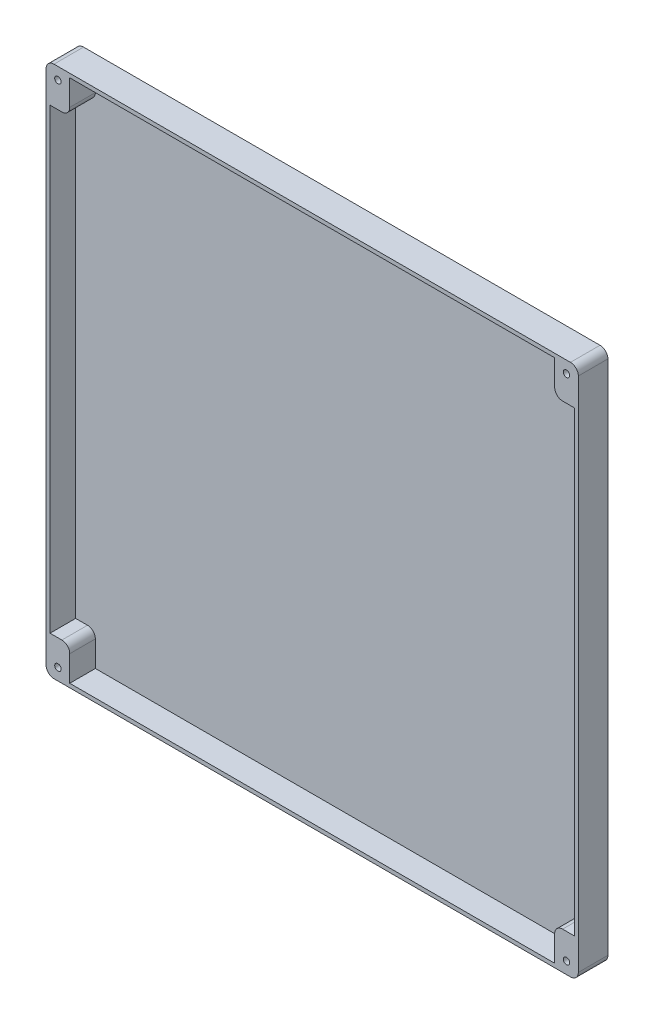
ISO-10303-21;
HEADER;
FILE_DESCRIPTION(('STEP AP214'),'2;1');
FILE_NAME('part.step','',(''),(''),'','','');
FILE_SCHEMA(('AUTOMOTIVE_DESIGN { 1 0 10303 214 1 1 1 1 }'));
ENDSEC;
DATA;
#1=APPLICATION_CONTEXT('core data for automotive mechanical design processes');
#2=APPLICATION_PROTOCOL_DEFINITION('international standard','automotive_design',2000,#1);
#3=PRODUCT_CONTEXT('',#1,'mechanical');
#4=PRODUCT('Part','Part','',(#3));
#5=PRODUCT_RELATED_PRODUCT_CATEGORY('part','',(#4));
#6=PRODUCT_DEFINITION_FORMATION('','',#4);
#7=PRODUCT_DEFINITION_CONTEXT('part definition',#1,'design');
#8=PRODUCT_DEFINITION('design','',#6,#7);
#9=PRODUCT_DEFINITION_SHAPE('','',#8);
#10=(LENGTH_UNIT() NAMED_UNIT(*) SI_UNIT(.MILLI.,.METRE.));
#11=(NAMED_UNIT(*) PLANE_ANGLE_UNIT() SI_UNIT($,.RADIAN.));
#12=(NAMED_UNIT(*) SI_UNIT($,.STERADIAN.) SOLID_ANGLE_UNIT());
#13=UNCERTAINTY_MEASURE_WITH_UNIT(LENGTH_MEASURE(1.E-05),#10,'distance_accuracy_value','');
#14=(GEOMETRIC_REPRESENTATION_CONTEXT(3) GLOBAL_UNCERTAINTY_ASSIGNED_CONTEXT((#13)) GLOBAL_UNIT_ASSIGNED_CONTEXT((#10,
#11,#12)) REPRESENTATION_CONTEXT('',''));
#15=CARTESIAN_POINT('',(0.,0.,0.));
#16=DIRECTION('',(0.,0.,1.));
#17=DIRECTION('',(1.,0.,0.));
#18=AXIS2_PLACEMENT_3D('',#15,#16,#17);
#19=CARTESIAN_POINT('',(0.,0.,15.));
#20=DIRECTION('',(1.,0.,0.));
#21=DIRECTION('',(0.,1.,0.));
#22=AXIS2_PLACEMENT_3D('',#19,#20,#21);
#23=PLANE('',#22);
#24=DIRECTION('',(0.,-1.,0.));
#25=VECTOR('',#24,1.);
#26=CARTESIAN_POINT('',(0.,0.,0.));
#27=LINE('',#26,#25);
#28=CARTESIAN_POINT('',(0.,-4.,0.));
#29=VERTEX_POINT('',#28);
#30=CARTESIAN_POINT('',(0.,-266.,0.));
#31=VERTEX_POINT('',#30);
#32=EDGE_CURVE('E275',#29,#31,#27,.T.);
#33=ORIENTED_EDGE('',*,*,#32,.T.);
#34=DIRECTION('',(0.,0.,-1.));
#35=VECTOR('',#34,1.);
#36=CARTESIAN_POINT('',(0.,-266.,15.));
#37=LINE('',#36,#35);
#38=CARTESIAN_POINT('',(0.,-266.,15.));
#39=VERTEX_POINT('',#38);
#40=EDGE_CURVE('E329',#31,#39,#37,.F.);
#41=ORIENTED_EDGE('',*,*,#40,.T.);
#42=DIRECTION('',(0.,-1.,0.));
#43=VECTOR('',#42,1.);
#44=CARTESIAN_POINT('',(0.,0.,15.));
#45=LINE('',#44,#43);
#46=CARTESIAN_POINT('',(0.,-4.,15.));
#47=VERTEX_POINT('',#46);
#48=EDGE_CURVE('E290',#47,#39,#45,.T.);
#49=ORIENTED_EDGE('',*,*,#48,.F.);
#50=DIRECTION('',(0.,0.,-1.));
#51=VECTOR('',#50,1.);
#52=CARTESIAN_POINT('',(0.,-4.,15.));
#53=LINE('',#52,#51);
#54=EDGE_CURVE('E326',#47,#29,#53,.T.);
#55=ORIENTED_EDGE('',*,*,#54,.T.);
#56=EDGE_LOOP('',(#33,#41,#49,#55));
#57=FACE_BOUND('',#56,.T.);
#58=ADVANCED_FACE('F31',(#57),#23,.F.);
#59=CARTESIAN_POINT('',(0.,-270.,15.));
#60=DIRECTION('',(0.,1.,0.));
#61=DIRECTION('',(0.,0.,1.));
#62=AXIS2_PLACEMENT_3D('',#59,#60,#61);
#63=PLANE('',#62);
#64=DIRECTION('',(1.,0.,0.));
#65=VECTOR('',#64,1.);
#66=CARTESIAN_POINT('',(0.,-270.,15.));
#67=LINE('',#66,#65);
#68=CARTESIAN_POINT('',(4.00000000000003,-270.,15.));
#69=VERTEX_POINT('',#68);
#70=CARTESIAN_POINT('',(266.,-270.,15.));
#71=VERTEX_POINT('',#70);
#72=EDGE_CURVE('E293',#69,#71,#67,.T.);
#73=ORIENTED_EDGE('',*,*,#72,.F.);
#74=DIRECTION('',(0.,0.,-1.));
#75=VECTOR('',#74,1.);
#76=CARTESIAN_POINT('',(4.00000000000003,-270.,15.));
#77=LINE('',#76,#75);
#78=CARTESIAN_POINT('',(4.00000000000003,-270.,0.));
#79=VERTEX_POINT('',#78);
#80=EDGE_CURVE('E315',#69,#79,#77,.T.);
#81=ORIENTED_EDGE('',*,*,#80,.T.);
#82=DIRECTION('',(1.,0.,0.));
#83=VECTOR('',#82,1.);
#84=CARTESIAN_POINT('',(0.,-270.,0.));
#85=LINE('',#84,#83);
#86=CARTESIAN_POINT('',(266.,-270.,0.));
#87=VERTEX_POINT('',#86);
#88=EDGE_CURVE('E306',#79,#87,#85,.T.);
#89=ORIENTED_EDGE('',*,*,#88,.T.);
#90=DIRECTION('',(0.,0.,-1.));
#91=VECTOR('',#90,1.);
#92=CARTESIAN_POINT('',(266.,-270.,15.));
#93=LINE('',#92,#91);
#94=EDGE_CURVE('E303',#87,#71,#93,.F.);
#95=ORIENTED_EDGE('',*,*,#94,.T.);
#96=EDGE_LOOP('',(#73,#81,#89,#95));
#97=FACE_BOUND('',#96,.T.);
#98=ADVANCED_FACE('F442',(#97),#63,.F.);
#99=CARTESIAN_POINT('',(270.,0.,15.));
#100=DIRECTION('',(-1.,0.,0.));
#101=DIRECTION('',(0.,-1.,0.));
#102=AXIS2_PLACEMENT_3D('',#99,#100,#101);
#103=PLANE('',#102);
#104=DIRECTION('',(0.,1.,0.));
#105=VECTOR('',#104,1.);
#106=CARTESIAN_POINT('',(270.,0.,15.));
#107=LINE('',#106,#105);
#108=CARTESIAN_POINT('',(270.,-266.,15.));
#109=VERTEX_POINT('',#108);
#110=CARTESIAN_POINT('',(270.,-4.,15.));
#111=VERTEX_POINT('',#110);
#112=EDGE_CURVE('E297',#109,#111,#107,.T.);
#113=ORIENTED_EDGE('',*,*,#112,.F.);
#114=DIRECTION('',(0.,0.,-1.));
#115=VECTOR('',#114,1.);
#116=CARTESIAN_POINT('',(270.,-266.,15.));
#117=LINE('',#116,#115);
#118=CARTESIAN_POINT('',(270.,-266.,0.));
#119=VERTEX_POINT('',#118);
#120=EDGE_CURVE('E341',#109,#119,#117,.T.);
#121=ORIENTED_EDGE('',*,*,#120,.T.);
#122=DIRECTION('',(0.,1.,0.));
#123=VECTOR('',#122,1.);
#124=CARTESIAN_POINT('',(270.,0.,0.));
#125=LINE('',#124,#123);
#126=CARTESIAN_POINT('',(270.,-4.,0.));
#127=VERTEX_POINT('',#126);
#128=EDGE_CURVE('E309',#119,#127,#125,.T.);
#129=ORIENTED_EDGE('',*,*,#128,.T.);
#130=DIRECTION('',(0.,0.,-1.));
#131=VECTOR('',#130,1.);
#132=CARTESIAN_POINT('',(270.,-4.,15.));
#133=LINE('',#132,#131);
#134=EDGE_CURVE('E339',#127,#111,#133,.F.);
#135=ORIENTED_EDGE('',*,*,#134,.T.);
#136=EDGE_LOOP('',(#113,#121,#129,#135));
#137=FACE_BOUND('',#136,.T.);
#138=ADVANCED_FACE('F448',(#137),#103,.F.);
#139=CARTESIAN_POINT('',(0.,0.,15.));
#140=DIRECTION('',(0.,-1.,0.));
#141=DIRECTION('',(0.,0.,-1.));
#142=AXIS2_PLACEMENT_3D('',#139,#140,#141);
#143=PLANE('',#142);
#144=DIRECTION('',(-1.,0.,0.));
#145=VECTOR('',#144,1.);
#146=CARTESIAN_POINT('',(0.,0.,0.));
#147=LINE('',#146,#145);
#148=CARTESIAN_POINT('',(266.,0.,0.));
#149=VERTEX_POINT('',#148);
#150=CARTESIAN_POINT('',(4.,0.,0.));
#151=VERTEX_POINT('',#150);
#152=EDGE_CURVE('E294',#149,#151,#147,.T.);
#153=ORIENTED_EDGE('',*,*,#152,.T.);
#154=DIRECTION('',(0.,0.,-1.));
#155=VECTOR('',#154,1.);
#156=CARTESIAN_POINT('',(4.,0.,15.));
#157=LINE('',#156,#155);
#158=CARTESIAN_POINT('',(4.,0.,15.));
#159=VERTEX_POINT('',#158);
#160=EDGE_CURVE('E347',#151,#159,#157,.F.);
#161=ORIENTED_EDGE('',*,*,#160,.T.);
#162=DIRECTION('',(-1.,0.,0.));
#163=VECTOR('',#162,1.);
#164=CARTESIAN_POINT('',(0.,0.,15.));
#165=LINE('',#164,#163);
#166=CARTESIAN_POINT('',(266.,0.,15.));
#167=VERTEX_POINT('',#166);
#168=EDGE_CURVE('E300',#167,#159,#165,.T.);
#169=ORIENTED_EDGE('',*,*,#168,.F.);
#170=DIRECTION('',(0.,0.,-1.));
#171=VECTOR('',#170,1.);
#172=CARTESIAN_POINT('',(266.,0.,15.));
#173=LINE('',#172,#171);
#174=EDGE_CURVE('E344',#167,#149,#173,.T.);
#175=ORIENTED_EDGE('',*,*,#174,.T.);
#176=EDGE_LOOP('',(#153,#161,#169,#175));
#177=FACE_BOUND('',#176,.T.);
#178=ADVANCED_FACE('F509',(#177),#143,.F.);
#179=CARTESIAN_POINT('',(0.,-270.,15.));
#180=DIRECTION('',(0.,0.,1.));
#181=DIRECTION('',(1.,0.,0.));
#182=AXIS2_PLACEMENT_3D('',#179,#180,#181);
#183=PLANE('',#182);
#184=CARTESIAN_POINT('',(264.,-6.,15.));
#185=DIRECTION('',(0.,0.,-1.));
#186=DIRECTION('',(-1.,0.,0.));
#187=AXIS2_PLACEMENT_3D('',#184,#185,#186);
#188=CIRCLE('',#187,1.63194999999999);
#189=CARTESIAN_POINT('',(262.36805,-6.,15.));
#190=VERTEX_POINT('',#189);
#191=EDGE_CURVE('E828',#190,#190,#188,.T.);
#192=ORIENTED_EDGE('',*,*,#191,.T.);
#193=EDGE_LOOP('',(#192));
#194=FACE_BOUND('',#193,.T.);
#195=CARTESIAN_POINT('',(6.,-6.,15.));
#196=DIRECTION('',(0.,0.,-1.));
#197=DIRECTION('',(-1.,0.,0.));
#198=AXIS2_PLACEMENT_3D('',#195,#196,#197);
#199=CIRCLE('',#198,1.63195);
#200=CARTESIAN_POINT('',(4.36805000000001,-6.,15.));
#201=VERTEX_POINT('',#200);
#202=EDGE_CURVE('E843',#201,#201,#199,.T.);
#203=ORIENTED_EDGE('',*,*,#202,.T.);
#204=EDGE_LOOP('',(#203));
#205=FACE_BOUND('',#204,.T.);
#206=CARTESIAN_POINT('',(6.,-264.,15.));
#207=DIRECTION('',(0.,0.,-1.));
#208=DIRECTION('',(-1.,0.,0.));
#209=AXIS2_PLACEMENT_3D('',#206,#207,#208);
#210=CIRCLE('',#209,1.63195);
#211=CARTESIAN_POINT('',(4.36805000000001,-264.,15.));
#212=VERTEX_POINT('',#211);
#213=EDGE_CURVE('E858',#212,#212,#210,.T.);
#214=ORIENTED_EDGE('',*,*,#213,.T.);
#215=EDGE_LOOP('',(#214));
#216=FACE_BOUND('',#215,.T.);
#217=CARTESIAN_POINT('',(264.,-264.,15.));
#218=DIRECTION('',(0.,0.,-1.));
#219=DIRECTION('',(-1.,0.,0.));
#220=AXIS2_PLACEMENT_3D('',#217,#218,#219);
#221=CIRCLE('',#220,1.63194999999999);
#222=CARTESIAN_POINT('',(262.36805,-264.,15.));
#223=VERTEX_POINT('',#222);
#224=EDGE_CURVE('E222',#223,#223,#221,.T.);
#225=ORIENTED_EDGE('',*,*,#224,.T.);
#226=EDGE_LOOP('',(#225));
#227=FACE_BOUND('',#226,.T.);
#228=DIRECTION('',(0.,1.,0.));
#229=VECTOR('',#228,1.);
#230=CARTESIAN_POINT('',(258.,-19.,15.));
#231=LINE('',#230,#229);
#232=CARTESIAN_POINT('',(258.,-15.,15.));
#233=VERTEX_POINT('',#232);
#234=CARTESIAN_POINT('',(258.,-2.,15.));
#235=VERTEX_POINT('',#234);
#236=EDGE_CURVE('E217',#233,#235,#231,.T.);
#237=ORIENTED_EDGE('',*,*,#236,.F.);
#238=CARTESIAN_POINT('',(262.,-15.,15.));
#239=DIRECTION('',(0.,0.,1.));
#240=DIRECTION('',(1.,0.,0.));
#241=AXIS2_PLACEMENT_3D('',#238,#239,#240);
#242=CIRCLE('',#241,4.);
#243=CARTESIAN_POINT('',(262.,-19.,15.));
#244=VERTEX_POINT('',#243);
#245=EDGE_CURVE('E358',#233,#244,#242,.T.);
#246=ORIENTED_EDGE('',*,*,#245,.T.);
#247=DIRECTION('',(-1.,0.,0.));
#248=VECTOR('',#247,1.);
#249=CARTESIAN_POINT('',(268.,-19.,15.));
#250=LINE('',#249,#248);
#251=CARTESIAN_POINT('',(268.,-19.,15.));
#252=VERTEX_POINT('',#251);
#253=EDGE_CURVE('E219',#252,#244,#250,.T.);
#254=ORIENTED_EDGE('',*,*,#253,.F.);
#255=DIRECTION('',(0.,1.,0.));
#256=VECTOR('',#255,1.);
#257=CARTESIAN_POINT('',(268.,-251.,15.));
#258=LINE('',#257,#256);
#259=CARTESIAN_POINT('',(268.,-251.,15.));
#260=VERTEX_POINT('',#259);
#261=EDGE_CURVE('E268',#260,#252,#258,.T.);
#262=ORIENTED_EDGE('',*,*,#261,.F.);
#263=DIRECTION('',(1.,0.,0.));
#264=VECTOR('',#263,1.);
#265=CARTESIAN_POINT('',(258.,-251.,15.));
#266=LINE('',#265,#264);
#267=CARTESIAN_POINT('',(262.,-251.,15.));
#268=VERTEX_POINT('',#267);
#269=EDGE_CURVE('E266',#268,#260,#266,.T.);
#270=ORIENTED_EDGE('',*,*,#269,.F.);
#271=CARTESIAN_POINT('',(262.,-255.,15.));
#272=DIRECTION('',(0.,0.,1.));
#273=DIRECTION('',(1.,0.,0.));
#274=AXIS2_PLACEMENT_3D('',#271,#272,#273);
#275=CIRCLE('',#274,4.);
#276=CARTESIAN_POINT('',(258.,-255.,15.));
#277=VERTEX_POINT('',#276);
#278=EDGE_CURVE('E356',#268,#277,#275,.T.);
#279=ORIENTED_EDGE('',*,*,#278,.T.);
#280=DIRECTION('',(0.,1.,0.));
#281=VECTOR('',#280,1.);
#282=CARTESIAN_POINT('',(258.,-268.,15.));
#283=LINE('',#282,#281);
#284=CARTESIAN_POINT('',(258.,-268.,15.));
#285=VERTEX_POINT('',#284);
#286=EDGE_CURVE('E263',#285,#277,#283,.T.);
#287=ORIENTED_EDGE('',*,*,#286,.F.);
#288=DIRECTION('',(1.,0.,0.));
#289=VECTOR('',#288,1.);
#290=CARTESIAN_POINT('',(12.0000000000001,-268.,15.));
#291=LINE('',#290,#289);
#292=CARTESIAN_POINT('',(12.0000000000001,-268.,15.));
#293=VERTEX_POINT('',#292);
#294=EDGE_CURVE('E260',#293,#285,#291,.T.);
#295=ORIENTED_EDGE('',*,*,#294,.F.);
#296=DIRECTION('',(0.,-1.,0.));
#297=VECTOR('',#296,1.);
#298=CARTESIAN_POINT('',(12.0000000000001,-251.,15.));
#299=LINE('',#298,#297);
#300=CARTESIAN_POINT('',(12.0000000000001,-255.,15.));
#301=VERTEX_POINT('',#300);
#302=EDGE_CURVE('E258',#301,#293,#299,.T.);
#303=ORIENTED_EDGE('',*,*,#302,.F.);
#304=CARTESIAN_POINT('',(8.00000000000009,-255.,15.));
#305=DIRECTION('',(0.,0.,1.));
#306=DIRECTION('',(1.,0.,0.));
#307=AXIS2_PLACEMENT_3D('',#304,#305,#306);
#308=CIRCLE('',#307,4.);
#309=CARTESIAN_POINT('',(8.00000000000009,-251.,15.));
#310=VERTEX_POINT('',#309);
#311=EDGE_CURVE('E352',#301,#310,#308,.T.);
#312=ORIENTED_EDGE('',*,*,#311,.T.);
#313=DIRECTION('',(1.,0.,0.));
#314=VECTOR('',#313,1.);
#315=CARTESIAN_POINT('',(2.00000000000003,-251.,15.));
#316=LINE('',#315,#314);
#317=CARTESIAN_POINT('',(2.00000000000003,-251.,15.));
#318=VERTEX_POINT('',#317);
#319=EDGE_CURVE('E256',#318,#310,#316,.T.);
#320=ORIENTED_EDGE('',*,*,#319,.F.);
#321=DIRECTION('',(0.,-1.,0.));
#322=VECTOR('',#321,1.);
#323=CARTESIAN_POINT('',(2.,-19.,15.));
#324=LINE('',#323,#322);
#325=CARTESIAN_POINT('',(2.,-19.,15.));
#326=VERTEX_POINT('',#325);
#327=EDGE_CURVE('E253',#326,#318,#324,.T.);
#328=ORIENTED_EDGE('',*,*,#327,.F.);
#329=DIRECTION('',(-1.,0.,0.));
#330=VECTOR('',#329,1.);
#331=CARTESIAN_POINT('',(12.,-19.,15.));
#332=LINE('',#331,#330);
#333=CARTESIAN_POINT('',(7.99999999999999,-19.,15.));
#334=VERTEX_POINT('',#333);
#335=EDGE_CURVE('E251',#334,#326,#332,.T.);
#336=ORIENTED_EDGE('',*,*,#335,.F.);
#337=CARTESIAN_POINT('',(8.,-15.,15.));
#338=DIRECTION('',(0.,0.,1.));
#339=DIRECTION('',(1.,0.,0.));
#340=AXIS2_PLACEMENT_3D('',#337,#338,#339);
#341=CIRCLE('',#340,4.);
#342=CARTESIAN_POINT('',(12.,-15.,15.));
#343=VERTEX_POINT('',#342);
#344=EDGE_CURVE('E354',#334,#343,#341,.T.);
#345=ORIENTED_EDGE('',*,*,#344,.T.);
#346=DIRECTION('',(0.,-1.,0.));
#347=VECTOR('',#346,1.);
#348=CARTESIAN_POINT('',(12.,-2.,15.));
#349=LINE('',#348,#347);
#350=CARTESIAN_POINT('',(12.,-2.,15.));
#351=VERTEX_POINT('',#350);
#352=EDGE_CURVE('E249',#351,#343,#349,.T.);
#353=ORIENTED_EDGE('',*,*,#352,.F.);
#354=DIRECTION('',(-1.,0.,0.));
#355=VECTOR('',#354,1.);
#356=CARTESIAN_POINT('',(258.,-2.,15.));
#357=LINE('',#356,#355);
#358=EDGE_CURVE('E199',#235,#351,#357,.T.);
#359=ORIENTED_EDGE('',*,*,#358,.F.);
#360=EDGE_LOOP('',(#237,#246,#254,#262,#270,#279,#287,#295,#303,#312,#320,#328,#336,#345,#353,#359));
#361=FACE_BOUND('',#360,.T.);
#362=ORIENTED_EDGE('',*,*,#48,.T.);
#363=CARTESIAN_POINT('',(4.00000000000003,-266.,15.));
#364=DIRECTION('',(0.,0.,1.));
#365=DIRECTION('',(1.,0.,0.));
#366=AXIS2_PLACEMENT_3D('',#363,#364,#365);
#367=CIRCLE('',#366,4.);
#368=EDGE_CURVE('E337',#39,#69,#367,.T.);
#369=ORIENTED_EDGE('',*,*,#368,.T.);
#370=ORIENTED_EDGE('',*,*,#72,.T.);
#371=CARTESIAN_POINT('',(266.,-266.,15.));
#372=DIRECTION('',(0.,0.,1.));
#373=DIRECTION('',(1.,0.,0.));
#374=AXIS2_PLACEMENT_3D('',#371,#372,#373);
#375=CIRCLE('',#374,4.);
#376=EDGE_CURVE('E335',#71,#109,#375,.T.);
#377=ORIENTED_EDGE('',*,*,#376,.T.);
#378=ORIENTED_EDGE('',*,*,#112,.T.);
#379=CARTESIAN_POINT('',(266.,-4.,15.));
#380=DIRECTION('',(0.,0.,1.));
#381=DIRECTION('',(1.,0.,0.));
#382=AXIS2_PLACEMENT_3D('',#379,#380,#381);
#383=CIRCLE('',#382,4.);
#384=EDGE_CURVE('E331',#111,#167,#383,.T.);
#385=ORIENTED_EDGE('',*,*,#384,.T.);
#386=ORIENTED_EDGE('',*,*,#168,.T.);
#387=CARTESIAN_POINT('',(4.,-4.,15.));
#388=DIRECTION('',(0.,0.,1.));
#389=DIRECTION('',(1.,0.,0.));
#390=AXIS2_PLACEMENT_3D('',#387,#388,#389);
#391=CIRCLE('',#390,4.);
#392=EDGE_CURVE('E333',#159,#47,#391,.T.);
#393=ORIENTED_EDGE('',*,*,#392,.T.);
#394=EDGE_LOOP('',(#362,#369,#370,#377,#378,#385,#386,#393));
#395=FACE_BOUND('',#394,.T.);
#396=ADVANCED_FACE('F389',(#194,#205,#216,#227,#361,#395),#183,.T.);
#397=CARTESIAN_POINT('',(0.,-270.,0.));
#398=DIRECTION('',(0.,0.,1.));
#399=DIRECTION('',(1.,0.,0.));
#400=AXIS2_PLACEMENT_3D('',#397,#398,#399);
#401=PLANE('',#400);
#402=CARTESIAN_POINT('',(264.,-6.,0.));
#403=DIRECTION('',(0.,0.,-1.));
#404=DIRECTION('',(-1.,0.,0.));
#405=AXIS2_PLACEMENT_3D('',#402,#403,#404);
#406=CIRCLE('',#405,3.80999999999998);
#407=CARTESIAN_POINT('',(260.19,-6.,0.));
#408=VERTEX_POINT('',#407);
#409=EDGE_CURVE('E818',#408,#408,#406,.T.);
#410=ORIENTED_EDGE('',*,*,#409,.F.);
#411=EDGE_LOOP('',(#410));
#412=FACE_BOUND('',#411,.T.);
#413=CARTESIAN_POINT('',(6.,-6.,0.));
#414=DIRECTION('',(0.,0.,-1.));
#415=DIRECTION('',(-1.,0.,0.));
#416=AXIS2_PLACEMENT_3D('',#413,#414,#415);
#417=CIRCLE('',#416,3.81);
#418=CARTESIAN_POINT('',(2.19,-6.,0.));
#419=VERTEX_POINT('',#418);
#420=EDGE_CURVE('E831',#419,#419,#417,.T.);
#421=ORIENTED_EDGE('',*,*,#420,.F.);
#422=EDGE_LOOP('',(#421));
#423=FACE_BOUND('',#422,.T.);
#424=CARTESIAN_POINT('',(6.,-264.,0.));
#425=DIRECTION('',(0.,0.,-1.));
#426=DIRECTION('',(-1.,0.,0.));
#427=AXIS2_PLACEMENT_3D('',#424,#425,#426);
#428=CIRCLE('',#427,3.81);
#429=CARTESIAN_POINT('',(2.19,-264.,0.));
#430=VERTEX_POINT('',#429);
#431=EDGE_CURVE('E846',#430,#430,#428,.T.);
#432=ORIENTED_EDGE('',*,*,#431,.F.);
#433=EDGE_LOOP('',(#432));
#434=FACE_BOUND('',#433,.T.);
#435=CARTESIAN_POINT('',(264.,-264.,0.));
#436=DIRECTION('',(0.,0.,-1.));
#437=DIRECTION('',(-1.,0.,0.));
#438=AXIS2_PLACEMENT_3D('',#435,#436,#437);
#439=CIRCLE('',#438,3.80999999999998);
#440=CARTESIAN_POINT('',(260.19,-264.,0.));
#441=VERTEX_POINT('',#440);
#442=EDGE_CURVE('E861',#441,#441,#439,.T.);
#443=ORIENTED_EDGE('',*,*,#442,.F.);
#444=EDGE_LOOP('',(#443));
#445=FACE_BOUND('',#444,.T.);
#446=ORIENTED_EDGE('',*,*,#88,.F.);
#447=CARTESIAN_POINT('',(4.00000000000003,-266.,0.));
#448=DIRECTION('',(0.,0.,1.));
#449=DIRECTION('',(1.,0.,0.));
#450=AXIS2_PLACEMENT_3D('',#447,#448,#449);
#451=CIRCLE('',#450,4.);
#452=EDGE_CURVE('E324',#79,#31,#451,.F.);
#453=ORIENTED_EDGE('',*,*,#452,.T.);
#454=ORIENTED_EDGE('',*,*,#32,.F.);
#455=CARTESIAN_POINT('',(4.,-4.,0.));
#456=DIRECTION('',(0.,0.,1.));
#457=DIRECTION('',(1.,0.,0.));
#458=AXIS2_PLACEMENT_3D('',#455,#456,#457);
#459=CIRCLE('',#458,4.);
#460=EDGE_CURVE('E320',#29,#151,#459,.F.);
#461=ORIENTED_EDGE('',*,*,#460,.T.);
#462=ORIENTED_EDGE('',*,*,#152,.F.);
#463=CARTESIAN_POINT('',(266.,-4.,0.));
#464=DIRECTION('',(0.,0.,1.));
#465=DIRECTION('',(1.,0.,0.));
#466=AXIS2_PLACEMENT_3D('',#463,#464,#465);
#467=CIRCLE('',#466,4.);
#468=EDGE_CURVE('E318',#149,#127,#467,.F.);
#469=ORIENTED_EDGE('',*,*,#468,.T.);
#470=ORIENTED_EDGE('',*,*,#128,.F.);
#471=CARTESIAN_POINT('',(266.,-266.,0.));
#472=DIRECTION('',(0.,0.,1.));
#473=DIRECTION('',(1.,0.,0.));
#474=AXIS2_PLACEMENT_3D('',#471,#472,#473);
#475=CIRCLE('',#474,4.);
#476=EDGE_CURVE('E322',#119,#87,#475,.F.);
#477=ORIENTED_EDGE('',*,*,#476,.T.);
#478=EDGE_LOOP('',(#446,#453,#454,#461,#462,#469,#470,#477));
#479=FACE_BOUND('',#478,.T.);
#480=ADVANCED_FACE('F457',(#412,#423,#434,#445,#479),#401,.F.);
#481=CARTESIAN_POINT('',(4.00000000000003,-266.,15.));
#482=DIRECTION('',(0.,0.,-1.));
#483=DIRECTION('',(-1.,0.,0.));
#484=AXIS2_PLACEMENT_3D('',#481,#482,#483);
#485=CYLINDRICAL_SURFACE('',#484,4.);
#486=ORIENTED_EDGE('',*,*,#368,.F.);
#487=ORIENTED_EDGE('',*,*,#40,.F.);
#488=ORIENTED_EDGE('',*,*,#452,.F.);
#489=ORIENTED_EDGE('',*,*,#80,.F.);
#490=EDGE_LOOP('',(#486,#487,#488,#489));
#491=FACE_BOUND('',#490,.T.);
#492=ADVANCED_FACE('F453',(#491),#485,.T.);
#493=CARTESIAN_POINT('',(266.,-266.,15.));
#494=DIRECTION('',(0.,0.,-1.));
#495=DIRECTION('',(-1.,0.,0.));
#496=AXIS2_PLACEMENT_3D('',#493,#494,#495);
#497=CYLINDRICAL_SURFACE('',#496,4.);
#498=ORIENTED_EDGE('',*,*,#376,.F.);
#499=ORIENTED_EDGE('',*,*,#94,.F.);
#500=ORIENTED_EDGE('',*,*,#476,.F.);
#501=ORIENTED_EDGE('',*,*,#120,.F.);
#502=EDGE_LOOP('',(#498,#499,#500,#501));
#503=FACE_BOUND('',#502,.T.);
#504=ADVANCED_FACE('F456',(#503),#497,.T.);
#505=CARTESIAN_POINT('',(4.,-4.,15.));
#506=DIRECTION('',(0.,0.,-1.));
#507=DIRECTION('',(-1.,0.,0.));
#508=AXIS2_PLACEMENT_3D('',#505,#506,#507);
#509=CYLINDRICAL_SURFACE('',#508,4.);
#510=ORIENTED_EDGE('',*,*,#392,.F.);
#511=ORIENTED_EDGE('',*,*,#160,.F.);
#512=ORIENTED_EDGE('',*,*,#460,.F.);
#513=ORIENTED_EDGE('',*,*,#54,.F.);
#514=EDGE_LOOP('',(#510,#511,#512,#513));
#515=FACE_BOUND('',#514,.T.);
#516=ADVANCED_FACE('F461',(#515),#509,.T.);
#517=CARTESIAN_POINT('',(266.,-4.,15.));
#518=DIRECTION('',(0.,0.,-1.));
#519=DIRECTION('',(-1.,0.,0.));
#520=AXIS2_PLACEMENT_3D('',#517,#518,#519);
#521=CYLINDRICAL_SURFACE('',#520,4.);
#522=ORIENTED_EDGE('',*,*,#384,.F.);
#523=ORIENTED_EDGE('',*,*,#134,.F.);
#524=ORIENTED_EDGE('',*,*,#468,.F.);
#525=ORIENTED_EDGE('',*,*,#174,.F.);
#526=EDGE_LOOP('',(#522,#523,#524,#525));
#527=FACE_BOUND('',#526,.T.);
#528=ADVANCED_FACE('F465',(#527),#521,.T.);
#529=CARTESIAN_POINT('',(258.,-2.,2.));
#530=DIRECTION('',(0.,1.,0.));
#531=DIRECTION('',(-1.,0.,0.));
#532=AXIS2_PLACEMENT_3D('',#529,#530,#531);
#533=PLANE('',#532);
#534=ORIENTED_EDGE('',*,*,#358,.T.);
#535=DIRECTION('',(0.,0.,1.));
#536=VECTOR('',#535,1.);
#537=CARTESIAN_POINT('',(12.,-2.,2.));
#538=LINE('',#537,#536);
#539=CARTESIAN_POINT('',(12.,-2.,2.));
#540=VERTEX_POINT('',#539);
#541=EDGE_CURVE('E192',#540,#351,#538,.T.);
#542=ORIENTED_EDGE('',*,*,#541,.F.);
#543=DIRECTION('',(-1.,0.,0.));
#544=VECTOR('',#543,1.);
#545=CARTESIAN_POINT('',(258.,-2.,2.));
#546=LINE('',#545,#544);
#547=CARTESIAN_POINT('',(258.,-2.,2.));
#548=VERTEX_POINT('',#547);
#549=EDGE_CURVE('E197',#548,#540,#546,.T.);
#550=ORIENTED_EDGE('',*,*,#549,.F.);
#551=DIRECTION('',(0.,0.,1.));
#552=VECTOR('',#551,1.);
#553=CARTESIAN_POINT('',(258.,-2.,2.));
#554=LINE('',#553,#552);
#555=EDGE_CURVE('E273',#548,#235,#554,.T.);
#556=ORIENTED_EDGE('',*,*,#555,.T.);
#557=EDGE_LOOP('',(#534,#542,#550,#556));
#558=FACE_BOUND('',#557,.T.);
#559=ADVANCED_FACE('F194',(#558),#533,.F.);
#560=CARTESIAN_POINT('',(258.,-19.,2.));
#561=DIRECTION('',(1.,0.,0.));
#562=DIRECTION('',(0.,0.,-1.));
#563=AXIS2_PLACEMENT_3D('',#560,#561,#562);
#564=PLANE('',#563);
#565=DIRECTION('',(0.,1.,0.));
#566=VECTOR('',#565,1.);
#567=CARTESIAN_POINT('',(258.,-19.,2.));
#568=LINE('',#567,#566);
#569=CARTESIAN_POINT('',(258.,-15.,2.));
#570=VERTEX_POINT('',#569);
#571=EDGE_CURVE('E204',#570,#548,#568,.T.);
#572=ORIENTED_EDGE('',*,*,#571,.F.);
#573=DIRECTION('',(0.,0.,1.));
#574=VECTOR('',#573,1.);
#575=CARTESIAN_POINT('',(258.,-15.,2.));
#576=LINE('',#575,#574);
#577=EDGE_CURVE('E349',#570,#233,#576,.T.);
#578=ORIENTED_EDGE('',*,*,#577,.T.);
#579=ORIENTED_EDGE('',*,*,#236,.T.);
#580=ORIENTED_EDGE('',*,*,#555,.F.);
#581=EDGE_LOOP('',(#572,#578,#579,#580));
#582=FACE_BOUND('',#581,.T.);
#583=ADVANCED_FACE('F431',(#582),#564,.F.);
#584=CARTESIAN_POINT('',(268.,-19.,2.));
#585=DIRECTION('',(0.,1.,0.));
#586=DIRECTION('',(0.,0.,1.));
#587=AXIS2_PLACEMENT_3D('',#584,#585,#586);
#588=PLANE('',#587);
#589=ORIENTED_EDGE('',*,*,#253,.T.);
#590=DIRECTION('',(0.,0.,1.));
#591=VECTOR('',#590,1.);
#592=CARTESIAN_POINT('',(262.,-19.,2.));
#593=LINE('',#592,#591);
#594=CARTESIAN_POINT('',(262.,-19.,2.));
#595=VERTEX_POINT('',#594);
#596=EDGE_CURVE('E360',#244,#595,#593,.F.);
#597=ORIENTED_EDGE('',*,*,#596,.T.);
#598=DIRECTION('',(-1.,0.,0.));
#599=VECTOR('',#598,1.);
#600=CARTESIAN_POINT('',(268.,-19.,2.));
#601=LINE('',#600,#599);
#602=CARTESIAN_POINT('',(268.,-19.,2.));
#603=VERTEX_POINT('',#602);
#604=EDGE_CURVE('E244',#603,#595,#601,.T.);
#605=ORIENTED_EDGE('',*,*,#604,.F.);
#606=DIRECTION('',(0.,0.,1.));
#607=VECTOR('',#606,1.);
#608=CARTESIAN_POINT('',(268.,-19.,2.));
#609=LINE('',#608,#607);
#610=EDGE_CURVE('E276',#603,#252,#609,.T.);
#611=ORIENTED_EDGE('',*,*,#610,.T.);
#612=EDGE_LOOP('',(#589,#597,#605,#611));
#613=FACE_BOUND('',#612,.T.);
#614=ADVANCED_FACE('F432',(#613),#588,.F.);
#615=CARTESIAN_POINT('',(268.,-251.,2.));
#616=DIRECTION('',(1.,0.,0.));
#617=DIRECTION('',(0.,0.,-1.));
#618=AXIS2_PLACEMENT_3D('',#615,#616,#617);
#619=PLANE('',#618);
#620=ORIENTED_EDGE('',*,*,#261,.T.);
#621=ORIENTED_EDGE('',*,*,#610,.F.);
#622=DIRECTION('',(0.,1.,0.));
#623=VECTOR('',#622,1.);
#624=CARTESIAN_POINT('',(268.,-251.,2.));
#625=LINE('',#624,#623);
#626=CARTESIAN_POINT('',(268.,-251.,2.));
#627=VERTEX_POINT('',#626);
#628=EDGE_CURVE('E241',#627,#603,#625,.T.);
#629=ORIENTED_EDGE('',*,*,#628,.F.);
#630=DIRECTION('',(0.,0.,1.));
#631=VECTOR('',#630,1.);
#632=CARTESIAN_POINT('',(268.,-251.,2.));
#633=LINE('',#632,#631);
#634=EDGE_CURVE('E278',#627,#260,#633,.T.);
#635=ORIENTED_EDGE('',*,*,#634,.T.);
#636=EDGE_LOOP('',(#620,#621,#629,#635));
#637=FACE_BOUND('',#636,.T.);
#638=ADVANCED_FACE('F421',(#637),#619,.F.);
#639=CARTESIAN_POINT('',(258.,-251.,2.));
#640=DIRECTION('',(0.,-1.,0.));
#641=DIRECTION('',(0.,0.,-1.));
#642=AXIS2_PLACEMENT_3D('',#639,#640,#641);
#643=PLANE('',#642);
#644=DIRECTION('',(1.,0.,0.));
#645=VECTOR('',#644,1.);
#646=CARTESIAN_POINT('',(258.,-251.,2.));
#647=LINE('',#646,#645);
#648=CARTESIAN_POINT('',(262.,-251.,2.));
#649=VERTEX_POINT('',#648);
#650=EDGE_CURVE('E239',#649,#627,#647,.T.);
#651=ORIENTED_EDGE('',*,*,#650,.F.);
#652=DIRECTION('',(0.,0.,1.));
#653=VECTOR('',#652,1.);
#654=CARTESIAN_POINT('',(262.,-251.,2.));
#655=LINE('',#654,#653);
#656=EDGE_CURVE('E362',#649,#268,#655,.T.);
#657=ORIENTED_EDGE('',*,*,#656,.T.);
#658=ORIENTED_EDGE('',*,*,#269,.T.);
#659=ORIENTED_EDGE('',*,*,#634,.F.);
#660=EDGE_LOOP('',(#651,#657,#658,#659));
#661=FACE_BOUND('',#660,.T.);
#662=ADVANCED_FACE('F416',(#661),#643,.F.);
#663=CARTESIAN_POINT('',(258.,-268.,2.));
#664=DIRECTION('',(1.,0.,0.));
#665=DIRECTION('',(0.,0.,-1.));
#666=AXIS2_PLACEMENT_3D('',#663,#664,#665);
#667=PLANE('',#666);
#668=ORIENTED_EDGE('',*,*,#286,.T.);
#669=DIRECTION('',(0.,0.,1.));
#670=VECTOR('',#669,1.);
#671=CARTESIAN_POINT('',(258.,-255.,2.));
#672=LINE('',#671,#670);
#673=CARTESIAN_POINT('',(258.,-255.,2.));
#674=VERTEX_POINT('',#673);
#675=EDGE_CURVE('E365',#277,#674,#672,.F.);
#676=ORIENTED_EDGE('',*,*,#675,.T.);
#677=DIRECTION('',(0.,1.,0.));
#678=VECTOR('',#677,1.);
#679=CARTESIAN_POINT('',(258.,-268.,2.));
#680=LINE('',#679,#678);
#681=CARTESIAN_POINT('',(258.,-268.,2.));
#682=VERTEX_POINT('',#681);
#683=EDGE_CURVE('E236',#682,#674,#680,.T.);
#684=ORIENTED_EDGE('',*,*,#683,.F.);
#685=DIRECTION('',(0.,0.,1.));
#686=VECTOR('',#685,1.);
#687=CARTESIAN_POINT('',(258.,-268.,2.));
#688=LINE('',#687,#686);
#689=EDGE_CURVE('E281',#682,#285,#688,.T.);
#690=ORIENTED_EDGE('',*,*,#689,.T.);
#691=EDGE_LOOP('',(#668,#676,#684,#690));
#692=FACE_BOUND('',#691,.T.);
#693=ADVANCED_FACE('F599',(#692),#667,.F.);
#694=CARTESIAN_POINT('',(12.0000000000001,-268.,2.));
#695=DIRECTION('',(0.,-1.,0.));
#696=DIRECTION('',(0.,0.,-1.));
#697=AXIS2_PLACEMENT_3D('',#694,#695,#696);
#698=PLANE('',#697);
#699=ORIENTED_EDGE('',*,*,#294,.T.);
#700=ORIENTED_EDGE('',*,*,#689,.F.);
#701=DIRECTION('',(1.,0.,0.));
#702=VECTOR('',#701,1.);
#703=CARTESIAN_POINT('',(12.0000000000001,-268.,2.));
#704=LINE('',#703,#702);
#705=CARTESIAN_POINT('',(12.0000000000001,-268.,2.));
#706=VERTEX_POINT('',#705);
#707=EDGE_CURVE('E233',#706,#682,#704,.T.);
#708=ORIENTED_EDGE('',*,*,#707,.F.);
#709=DIRECTION('',(0.,0.,1.));
#710=VECTOR('',#709,1.);
#711=CARTESIAN_POINT('',(12.0000000000001,-268.,2.));
#712=LINE('',#711,#710);
#713=EDGE_CURVE('E283',#706,#293,#712,.T.);
#714=ORIENTED_EDGE('',*,*,#713,.T.);
#715=EDGE_LOOP('',(#699,#700,#708,#714));
#716=FACE_BOUND('',#715,.T.);
#717=ADVANCED_FACE('F404',(#716),#698,.F.);
#718=CARTESIAN_POINT('',(12.0000000000001,-251.,2.));
#719=DIRECTION('',(-1.,0.,0.));
#720=DIRECTION('',(0.,-1.,0.));
#721=AXIS2_PLACEMENT_3D('',#718,#719,#720);
#722=PLANE('',#721);
#723=DIRECTION('',(0.,-1.,0.));
#724=VECTOR('',#723,1.);
#725=CARTESIAN_POINT('',(12.0000000000001,-251.,2.));
#726=LINE('',#725,#724);
#727=CARTESIAN_POINT('',(12.0000000000001,-255.,2.));
#728=VERTEX_POINT('',#727);
#729=EDGE_CURVE('E231',#728,#706,#726,.T.);
#730=ORIENTED_EDGE('',*,*,#729,.F.);
#731=DIRECTION('',(0.,0.,1.));
#732=VECTOR('',#731,1.);
#733=CARTESIAN_POINT('',(12.0000000000001,-255.,2.));
#734=LINE('',#733,#732);
#735=EDGE_CURVE('E371',#728,#301,#734,.T.);
#736=ORIENTED_EDGE('',*,*,#735,.T.);
#737=ORIENTED_EDGE('',*,*,#302,.T.);
#738=ORIENTED_EDGE('',*,*,#713,.F.);
#739=EDGE_LOOP('',(#730,#736,#737,#738));
#740=FACE_BOUND('',#739,.T.);
#741=ADVANCED_FACE('F399',(#740),#722,.F.);
#742=CARTESIAN_POINT('',(2.00000000000003,-251.,2.));
#743=DIRECTION('',(0.,-1.,0.));
#744=DIRECTION('',(0.,0.,-1.));
#745=AXIS2_PLACEMENT_3D('',#742,#743,#744);
#746=PLANE('',#745);
#747=ORIENTED_EDGE('',*,*,#319,.T.);
#748=DIRECTION('',(0.,0.,1.));
#749=VECTOR('',#748,1.);
#750=CARTESIAN_POINT('',(8.00000000000009,-251.,2.));
#751=LINE('',#750,#749);
#752=CARTESIAN_POINT('',(8.00000000000009,-251.,2.));
#753=VERTEX_POINT('',#752);
#754=EDGE_CURVE('E46',#310,#753,#751,.F.);
#755=ORIENTED_EDGE('',*,*,#754,.T.);
#756=DIRECTION('',(1.,0.,0.));
#757=VECTOR('',#756,1.);
#758=CARTESIAN_POINT('',(2.00000000000003,-251.,2.));
#759=LINE('',#758,#757);
#760=CARTESIAN_POINT('',(2.00000000000003,-251.,2.));
#761=VERTEX_POINT('',#760);
#762=EDGE_CURVE('E229',#761,#753,#759,.T.);
#763=ORIENTED_EDGE('',*,*,#762,.F.);
#764=DIRECTION('',(0.,0.,1.));
#765=VECTOR('',#764,1.);
#766=CARTESIAN_POINT('',(2.00000000000003,-251.,2.));
#767=LINE('',#766,#765);
#768=EDGE_CURVE('E286',#761,#318,#767,.T.);
#769=ORIENTED_EDGE('',*,*,#768,.T.);
#770=EDGE_LOOP('',(#747,#755,#763,#769));
#771=FACE_BOUND('',#770,.T.);
#772=ADVANCED_FACE('F618',(#771),#746,.F.);
#773=CARTESIAN_POINT('',(2.,-19.,2.));
#774=DIRECTION('',(-1.,0.,0.));
#775=DIRECTION('',(0.,-1.,0.));
#776=AXIS2_PLACEMENT_3D('',#773,#774,#775);
#777=PLANE('',#776);
#778=ORIENTED_EDGE('',*,*,#327,.T.);
#779=ORIENTED_EDGE('',*,*,#768,.F.);
#780=DIRECTION('',(0.,-1.,0.));
#781=VECTOR('',#780,1.);
#782=CARTESIAN_POINT('',(2.,-19.,2.));
#783=LINE('',#782,#781);
#784=CARTESIAN_POINT('',(2.,-19.,2.));
#785=VERTEX_POINT('',#784);
#786=EDGE_CURVE('E226',#785,#761,#783,.T.);
#787=ORIENTED_EDGE('',*,*,#786,.F.);
#788=DIRECTION('',(0.,0.,1.));
#789=VECTOR('',#788,1.);
#790=CARTESIAN_POINT('',(2.,-19.,2.));
#791=LINE('',#790,#789);
#792=EDGE_CURVE('E203',#785,#326,#791,.T.);
#793=ORIENTED_EDGE('',*,*,#792,.T.);
#794=EDGE_LOOP('',(#778,#779,#787,#793));
#795=FACE_BOUND('',#794,.T.);
#796=ADVANCED_FACE('F394',(#795),#777,.F.);
#797=CARTESIAN_POINT('',(12.,-19.,2.));
#798=DIRECTION('',(0.,1.,0.));
#799=DIRECTION('',(-1.,0.,0.));
#800=AXIS2_PLACEMENT_3D('',#797,#798,#799);
#801=PLANE('',#800);
#802=DIRECTION('',(-1.,0.,0.));
#803=VECTOR('',#802,1.);
#804=CARTESIAN_POINT('',(12.,-19.,2.));
#805=LINE('',#804,#803);
#806=CARTESIAN_POINT('',(7.99999999999999,-19.,2.));
#807=VERTEX_POINT('',#806);
#808=EDGE_CURVE('E212',#807,#785,#805,.T.);
#809=ORIENTED_EDGE('',*,*,#808,.F.);
#810=DIRECTION('',(0.,0.,1.));
#811=VECTOR('',#810,1.);
#812=CARTESIAN_POINT('',(7.99999999999999,-19.,2.));
#813=LINE('',#812,#811);
#814=EDGE_CURVE('E367',#807,#334,#813,.T.);
#815=ORIENTED_EDGE('',*,*,#814,.T.);
#816=ORIENTED_EDGE('',*,*,#335,.T.);
#817=ORIENTED_EDGE('',*,*,#792,.F.);
#818=EDGE_LOOP('',(#809,#815,#816,#817));
#819=FACE_BOUND('',#818,.T.);
#820=ADVANCED_FACE('F383',(#819),#801,.F.);
#821=CARTESIAN_POINT('',(12.,-2.,2.));
#822=DIRECTION('',(-1.,0.,0.));
#823=DIRECTION('',(0.,-1.,0.));
#824=AXIS2_PLACEMENT_3D('',#821,#822,#823);
#825=PLANE('',#824);
#826=ORIENTED_EDGE('',*,*,#352,.T.);
#827=DIRECTION('',(0.,0.,1.));
#828=VECTOR('',#827,1.);
#829=CARTESIAN_POINT('',(12.,-15.,2.));
#830=LINE('',#829,#828);
#831=CARTESIAN_POINT('',(12.,-15.,2.));
#832=VERTEX_POINT('',#831);
#833=EDGE_CURVE('E210',#343,#832,#830,.F.);
#834=ORIENTED_EDGE('',*,*,#833,.T.);
#835=DIRECTION('',(0.,-1.,0.));
#836=VECTOR('',#835,1.);
#837=CARTESIAN_POINT('',(12.,-2.,2.));
#838=LINE('',#837,#836);
#839=EDGE_CURVE('E207',#540,#832,#838,.T.);
#840=ORIENTED_EDGE('',*,*,#839,.F.);
#841=ORIENTED_EDGE('',*,*,#541,.T.);
#842=EDGE_LOOP('',(#826,#834,#840,#841));
#843=FACE_BOUND('',#842,.T.);
#844=ADVANCED_FACE('F208',(#843),#825,.F.);
#845=CARTESIAN_POINT('',(12.,-2.,2.));
#846=DIRECTION('',(0.,0.,1.));
#847=DIRECTION('',(1.,0.,0.));
#848=AXIS2_PLACEMENT_3D('',#845,#846,#847);
#849=PLANE('',#848);
#850=ORIENTED_EDGE('',*,*,#549,.T.);
#851=ORIENTED_EDGE('',*,*,#839,.T.);
#852=CARTESIAN_POINT('',(8.,-15.,2.));
#853=DIRECTION('',(0.,0.,1.));
#854=DIRECTION('',(1.,0.,0.));
#855=AXIS2_PLACEMENT_3D('',#852,#853,#854);
#856=CIRCLE('',#855,4.);
#857=EDGE_CURVE('E39',#832,#807,#856,.F.);
#858=ORIENTED_EDGE('',*,*,#857,.T.);
#859=ORIENTED_EDGE('',*,*,#808,.T.);
#860=ORIENTED_EDGE('',*,*,#786,.T.);
#861=ORIENTED_EDGE('',*,*,#762,.T.);
#862=CARTESIAN_POINT('',(8.00000000000009,-255.,2.));
#863=DIRECTION('',(0.,0.,1.));
#864=DIRECTION('',(1.,0.,0.));
#865=AXIS2_PLACEMENT_3D('',#862,#863,#864);
#866=CIRCLE('',#865,4.);
#867=EDGE_CURVE('E11',#753,#728,#866,.F.);
#868=ORIENTED_EDGE('',*,*,#867,.T.);
#869=ORIENTED_EDGE('',*,*,#729,.T.);
#870=ORIENTED_EDGE('',*,*,#707,.T.);
#871=ORIENTED_EDGE('',*,*,#683,.T.);
#872=CARTESIAN_POINT('',(262.,-255.,2.));
#873=DIRECTION('',(0.,0.,1.));
#874=DIRECTION('',(1.,0.,0.));
#875=AXIS2_PLACEMENT_3D('',#872,#873,#874);
#876=CIRCLE('',#875,4.);
#877=EDGE_CURVE('E377',#674,#649,#876,.F.);
#878=ORIENTED_EDGE('',*,*,#877,.T.);
#879=ORIENTED_EDGE('',*,*,#650,.T.);
#880=ORIENTED_EDGE('',*,*,#628,.T.);
#881=ORIENTED_EDGE('',*,*,#604,.T.);
#882=CARTESIAN_POINT('',(262.,-15.,2.));
#883=DIRECTION('',(0.,0.,1.));
#884=DIRECTION('',(1.,0.,0.));
#885=AXIS2_PLACEMENT_3D('',#882,#883,#884);
#886=CIRCLE('',#885,4.);
#887=EDGE_CURVE('E375',#595,#570,#886,.F.);
#888=ORIENTED_EDGE('',*,*,#887,.T.);
#889=ORIENTED_EDGE('',*,*,#571,.T.);
#890=EDGE_LOOP('',(#850,#851,#858,#859,#860,#861,#868,#869,#870,#871,#878,#879,#880,#881,#888,#889));
#891=FACE_BOUND('',#890,.T.);
#892=ADVANCED_FACE('F214',(#891),#849,.T.);
#893=CARTESIAN_POINT('',(262.,-15.,2.));
#894=DIRECTION('',(0.,0.,1.));
#895=DIRECTION('',(1.,0.,0.));
#896=AXIS2_PLACEMENT_3D('',#893,#894,#895);
#897=CYLINDRICAL_SURFACE('',#896,4.);
#898=ORIENTED_EDGE('',*,*,#887,.F.);
#899=ORIENTED_EDGE('',*,*,#596,.F.);
#900=ORIENTED_EDGE('',*,*,#245,.F.);
#901=ORIENTED_EDGE('',*,*,#577,.F.);
#902=EDGE_LOOP('',(#898,#899,#900,#901));
#903=FACE_BOUND('',#902,.T.);
#904=ADVANCED_FACE('F429',(#903),#897,.T.);
#905=CARTESIAN_POINT('',(262.,-255.,2.));
#906=DIRECTION('',(0.,0.,1.));
#907=DIRECTION('',(1.,0.,0.));
#908=AXIS2_PLACEMENT_3D('',#905,#906,#907);
#909=CYLINDRICAL_SURFACE('',#908,4.);
#910=ORIENTED_EDGE('',*,*,#877,.F.);
#911=ORIENTED_EDGE('',*,*,#675,.F.);
#912=ORIENTED_EDGE('',*,*,#278,.F.);
#913=ORIENTED_EDGE('',*,*,#656,.F.);
#914=EDGE_LOOP('',(#910,#911,#912,#913));
#915=FACE_BOUND('',#914,.T.);
#916=ADVANCED_FACE('F413',(#915),#909,.T.);
#917=CARTESIAN_POINT('',(8.,-15.,2.));
#918=DIRECTION('',(0.,0.,1.));
#919=DIRECTION('',(1.,0.,0.));
#920=AXIS2_PLACEMENT_3D('',#917,#918,#919);
#921=CYLINDRICAL_SURFACE('',#920,4.);
#922=ORIENTED_EDGE('',*,*,#857,.F.);
#923=ORIENTED_EDGE('',*,*,#833,.F.);
#924=ORIENTED_EDGE('',*,*,#344,.F.);
#925=ORIENTED_EDGE('',*,*,#814,.F.);
#926=EDGE_LOOP('',(#922,#923,#924,#925));
#927=FACE_BOUND('',#926,.T.);
#928=ADVANCED_FACE('F386',(#927),#921,.T.);
#929=CARTESIAN_POINT('',(8.00000000000009,-255.,2.));
#930=DIRECTION('',(0.,0.,1.));
#931=DIRECTION('',(1.,0.,0.));
#932=AXIS2_PLACEMENT_3D('',#929,#930,#931);
#933=CYLINDRICAL_SURFACE('',#932,4.);
#934=ORIENTED_EDGE('',*,*,#867,.F.);
#935=ORIENTED_EDGE('',*,*,#754,.F.);
#936=ORIENTED_EDGE('',*,*,#311,.F.);
#937=ORIENTED_EDGE('',*,*,#735,.F.);
#938=EDGE_LOOP('',(#934,#935,#936,#937));
#939=FACE_BOUND('',#938,.T.);
#940=ADVANCED_FACE('F33',(#939),#933,.T.);
#941=CARTESIAN_POINT('',(264.,-264.,0.));
#942=DIRECTION('',(0.,0.,-1.));
#943=DIRECTION('',(-1.,0.,0.));
#944=AXIS2_PLACEMENT_3D('',#941,#942,#943);
#945=CYLINDRICAL_SURFACE('',#944,1.63194999999999);
#946=ORIENTED_EDGE('',*,*,#224,.F.);
#947=EDGE_LOOP('',(#946));
#948=FACE_BOUND('',#947,.T.);
#949=CARTESIAN_POINT('',(264.,-264.,4.031996));
#950=DIRECTION('',(0.,0.,-1.));
#951=DIRECTION('',(-1.,0.,0.));
#952=AXIS2_PLACEMENT_3D('',#949,#950,#951);
#953=CIRCLE('',#952,1.63194999999999);
#954=CARTESIAN_POINT('',(262.36805,-264.,4.031996));
#955=VERTEX_POINT('',#954);
#956=EDGE_CURVE('E869',#955,#955,#953,.T.);
#957=ORIENTED_EDGE('',*,*,#956,.T.);
#958=EDGE_LOOP('',(#957));
#959=FACE_BOUND('',#958,.T.);
#960=ADVANCED_FACE('F477',(#948,#959),#945,.F.);
#961=CARTESIAN_POINT('',(267.175,-264.,4.031996));
#962=DIRECTION('',(0.,0.,1.));
#963=DIRECTION('',(1.,0.,0.));
#964=AXIS2_PLACEMENT_3D('',#961,#962,#963);
#965=PLANE('',#964);
#966=ORIENTED_EDGE('',*,*,#956,.F.);
#967=EDGE_LOOP('',(#966));
#968=FACE_BOUND('',#967,.T.);
#969=CARTESIAN_POINT('',(264.,-264.,4.031996));
#970=DIRECTION('',(0.,0.,-1.));
#971=DIRECTION('',(-1.,0.,0.));
#972=AXIS2_PLACEMENT_3D('',#969,#970,#971);
#973=CIRCLE('',#972,3.17499999999998);
#974=CARTESIAN_POINT('',(260.825,-264.,4.031996));
#975=VERTEX_POINT('',#974);
#976=EDGE_CURVE('E867',#975,#975,#973,.T.);
#977=ORIENTED_EDGE('',*,*,#976,.T.);
#978=EDGE_LOOP('',(#977));
#979=FACE_BOUND('',#978,.T.);
#980=ADVANCED_FACE('F481',(#968,#979),#965,.F.);
#981=CARTESIAN_POINT('',(264.,-264.,0.));
#982=DIRECTION('',(0.,0.,-1.));
#983=DIRECTION('',(-1.,0.,0.));
#984=AXIS2_PLACEMENT_3D('',#981,#982,#983);
#985=CYLINDRICAL_SURFACE('',#984,3.17499999999998);
#986=ORIENTED_EDGE('',*,*,#976,.F.);
#987=EDGE_LOOP('',(#986));
#988=FACE_BOUND('',#987,.T.);
#989=CARTESIAN_POINT('',(264.,-264.,0.635));
#990=DIRECTION('',(0.,0.,-1.));
#991=DIRECTION('',(-1.,0.,0.));
#992=AXIS2_PLACEMENT_3D('',#989,#990,#991);
#993=CIRCLE('',#992,3.17499999999998);
#994=CARTESIAN_POINT('',(260.825,-264.,0.635));
#995=VERTEX_POINT('',#994);
#996=EDGE_CURVE('E864',#995,#995,#993,.T.);
#997=ORIENTED_EDGE('',*,*,#996,.T.);
#998=EDGE_LOOP('',(#997));
#999=FACE_BOUND('',#998,.T.);
#1000=ADVANCED_FACE('F487',(#988,#999),#985,.F.);
#1001=CARTESIAN_POINT('',(264.,-264.,0.));
#1002=DIRECTION('',(0.,0.,-1.));
#1003=DIRECTION('',(-1.,0.,0.));
#1004=AXIS2_PLACEMENT_3D('',#1001,#1002,#1003);
#1005=CONICAL_SURFACE('',#1004,3.80999999999998,0.785398163397446);
#1006=ORIENTED_EDGE('',*,*,#996,.F.);
#1007=EDGE_LOOP('',(#1006));
#1008=FACE_BOUND('',#1007,.T.);
#1009=ORIENTED_EDGE('',*,*,#442,.T.);
#1010=EDGE_LOOP('',(#1009));
#1011=FACE_BOUND('',#1010,.T.);
#1012=ADVANCED_FACE('F679',(#1008,#1011),#1005,.F.);
#1013=CARTESIAN_POINT('',(6.,-264.,0.));
#1014=DIRECTION('',(0.,0.,-1.));
#1015=DIRECTION('',(-1.,0.,0.));
#1016=AXIS2_PLACEMENT_3D('',#1013,#1014,#1015);
#1017=CYLINDRICAL_SURFACE('',#1016,1.63195);
#1018=ORIENTED_EDGE('',*,*,#213,.F.);
#1019=EDGE_LOOP('',(#1018));
#1020=FACE_BOUND('',#1019,.T.);
#1021=CARTESIAN_POINT('',(6.,-264.,4.031996));
#1022=DIRECTION('',(0.,0.,-1.));
#1023=DIRECTION('',(-1.,0.,0.));
#1024=AXIS2_PLACEMENT_3D('',#1021,#1022,#1023);
#1025=CIRCLE('',#1024,1.63195);
#1026=CARTESIAN_POINT('',(4.36805,-264.,4.031996));
#1027=VERTEX_POINT('',#1026);
#1028=EDGE_CURVE('E855',#1027,#1027,#1025,.T.);
#1029=ORIENTED_EDGE('',*,*,#1028,.T.);
#1030=EDGE_LOOP('',(#1029));
#1031=FACE_BOUND('',#1030,.T.);
#1032=ADVANCED_FACE('F687',(#1020,#1031),#1017,.F.);
#1033=CARTESIAN_POINT('',(9.175,-264.,4.031996));
#1034=DIRECTION('',(0.,0.,1.));
#1035=DIRECTION('',(1.,0.,0.));
#1036=AXIS2_PLACEMENT_3D('',#1033,#1034,#1035);
#1037=PLANE('',#1036);
#1038=ORIENTED_EDGE('',*,*,#1028,.F.);
#1039=EDGE_LOOP('',(#1038));
#1040=FACE_BOUND('',#1039,.T.);
#1041=CARTESIAN_POINT('',(6.,-264.,4.031996));
#1042=DIRECTION('',(0.,0.,-1.));
#1043=DIRECTION('',(-1.,0.,0.));
#1044=AXIS2_PLACEMENT_3D('',#1041,#1042,#1043);
#1045=CIRCLE('',#1044,3.175);
#1046=CARTESIAN_POINT('',(2.825,-264.,4.031996));
#1047=VERTEX_POINT('',#1046);
#1048=EDGE_CURVE('E852',#1047,#1047,#1045,.T.);
#1049=ORIENTED_EDGE('',*,*,#1048,.T.);
#1050=EDGE_LOOP('',(#1049));
#1051=FACE_BOUND('',#1050,.T.);
#1052=ADVANCED_FACE('F696',(#1040,#1051),#1037,.F.);
#1053=CARTESIAN_POINT('',(6.,-264.,0.));
#1054=DIRECTION('',(0.,0.,-1.));
#1055=DIRECTION('',(-1.,0.,0.));
#1056=AXIS2_PLACEMENT_3D('',#1053,#1054,#1055);
#1057=CYLINDRICAL_SURFACE('',#1056,3.175);
#1058=ORIENTED_EDGE('',*,*,#1048,.F.);
#1059=EDGE_LOOP('',(#1058));
#1060=FACE_BOUND('',#1059,.T.);
#1061=CARTESIAN_POINT('',(6.,-264.,0.635));
#1062=DIRECTION('',(0.,0.,-1.));
#1063=DIRECTION('',(-1.,0.,0.));
#1064=AXIS2_PLACEMENT_3D('',#1061,#1062,#1063);
#1065=CIRCLE('',#1064,3.175);
#1066=CARTESIAN_POINT('',(2.825,-264.,0.635));
#1067=VERTEX_POINT('',#1066);
#1068=EDGE_CURVE('E849',#1067,#1067,#1065,.T.);
#1069=ORIENTED_EDGE('',*,*,#1068,.T.);
#1070=EDGE_LOOP('',(#1069));
#1071=FACE_BOUND('',#1070,.T.);
#1072=ADVANCED_FACE('F705',(#1060,#1071),#1057,.F.);
#1073=CARTESIAN_POINT('',(6.,-264.,0.));
#1074=DIRECTION('',(0.,0.,-1.));
#1075=DIRECTION('',(-1.,0.,0.));
#1076=AXIS2_PLACEMENT_3D('',#1073,#1074,#1075);
#1077=CONICAL_SURFACE('',#1076,3.81,0.785398163397449);
#1078=ORIENTED_EDGE('',*,*,#1068,.F.);
#1079=EDGE_LOOP('',(#1078));
#1080=FACE_BOUND('',#1079,.T.);
#1081=ORIENTED_EDGE('',*,*,#431,.T.);
#1082=EDGE_LOOP('',(#1081));
#1083=FACE_BOUND('',#1082,.T.);
#1084=ADVANCED_FACE('F714',(#1080,#1083),#1077,.F.);
#1085=CARTESIAN_POINT('',(6.,-6.,0.));
#1086=DIRECTION('',(0.,0.,-1.));
#1087=DIRECTION('',(-1.,0.,0.));
#1088=AXIS2_PLACEMENT_3D('',#1085,#1086,#1087);
#1089=CYLINDRICAL_SURFACE('',#1088,1.63195);
#1090=ORIENTED_EDGE('',*,*,#202,.F.);
#1091=EDGE_LOOP('',(#1090));
#1092=FACE_BOUND('',#1091,.T.);
#1093=CARTESIAN_POINT('',(6.,-6.,4.031996));
#1094=DIRECTION('',(0.,0.,-1.));
#1095=DIRECTION('',(-1.,0.,0.));
#1096=AXIS2_PLACEMENT_3D('',#1093,#1094,#1095);
#1097=CIRCLE('',#1096,1.63195);
#1098=CARTESIAN_POINT('',(4.36805,-6.,4.031996));
#1099=VERTEX_POINT('',#1098);
#1100=EDGE_CURVE('E840',#1099,#1099,#1097,.T.);
#1101=ORIENTED_EDGE('',*,*,#1100,.T.);
#1102=EDGE_LOOP('',(#1101));
#1103=FACE_BOUND('',#1102,.T.);
#1104=ADVANCED_FACE('F723',(#1092,#1103),#1089,.F.);
#1105=CARTESIAN_POINT('',(9.175,-6.,4.031996));
#1106=DIRECTION('',(0.,0.,1.));
#1107=DIRECTION('',(1.,0.,0.));
#1108=AXIS2_PLACEMENT_3D('',#1105,#1106,#1107);
#1109=PLANE('',#1108);
#1110=ORIENTED_EDGE('',*,*,#1100,.F.);
#1111=EDGE_LOOP('',(#1110));
#1112=FACE_BOUND('',#1111,.T.);
#1113=CARTESIAN_POINT('',(6.,-6.,4.031996));
#1114=DIRECTION('',(0.,0.,-1.));
#1115=DIRECTION('',(-1.,0.,0.));
#1116=AXIS2_PLACEMENT_3D('',#1113,#1114,#1115);
#1117=CIRCLE('',#1116,3.175);
#1118=CARTESIAN_POINT('',(2.825,-6.,4.031996));
#1119=VERTEX_POINT('',#1118);
#1120=EDGE_CURVE('E837',#1119,#1119,#1117,.T.);
#1121=ORIENTED_EDGE('',*,*,#1120,.T.);
#1122=EDGE_LOOP('',(#1121));
#1123=FACE_BOUND('',#1122,.T.);
#1124=ADVANCED_FACE('F732',(#1112,#1123),#1109,.F.);
#1125=CARTESIAN_POINT('',(6.,-6.,0.));
#1126=DIRECTION('',(0.,0.,-1.));
#1127=DIRECTION('',(-1.,0.,0.));
#1128=AXIS2_PLACEMENT_3D('',#1125,#1126,#1127);
#1129=CYLINDRICAL_SURFACE('',#1128,3.175);
#1130=ORIENTED_EDGE('',*,*,#1120,.F.);
#1131=EDGE_LOOP('',(#1130));
#1132=FACE_BOUND('',#1131,.T.);
#1133=CARTESIAN_POINT('',(6.,-6.,0.635));
#1134=DIRECTION('',(0.,0.,-1.));
#1135=DIRECTION('',(-1.,0.,0.));
#1136=AXIS2_PLACEMENT_3D('',#1133,#1134,#1135);
#1137=CIRCLE('',#1136,3.175);
#1138=CARTESIAN_POINT('',(2.825,-6.,0.635));
#1139=VERTEX_POINT('',#1138);
#1140=EDGE_CURVE('E834',#1139,#1139,#1137,.T.);
#1141=ORIENTED_EDGE('',*,*,#1140,.T.);
#1142=EDGE_LOOP('',(#1141));
#1143=FACE_BOUND('',#1142,.T.);
#1144=ADVANCED_FACE('F741',(#1132,#1143),#1129,.F.);
#1145=CARTESIAN_POINT('',(6.,-6.,0.));
#1146=DIRECTION('',(0.,0.,-1.));
#1147=DIRECTION('',(-1.,0.,0.));
#1148=AXIS2_PLACEMENT_3D('',#1145,#1146,#1147);
#1149=CONICAL_SURFACE('',#1148,3.81,0.785398163397449);
#1150=ORIENTED_EDGE('',*,*,#1140,.F.);
#1151=EDGE_LOOP('',(#1150));
#1152=FACE_BOUND('',#1151,.T.);
#1153=ORIENTED_EDGE('',*,*,#420,.T.);
#1154=EDGE_LOOP('',(#1153));
#1155=FACE_BOUND('',#1154,.T.);
#1156=ADVANCED_FACE('F750',(#1152,#1155),#1149,.F.);
#1157=CARTESIAN_POINT('',(264.,-6.,0.));
#1158=DIRECTION('',(0.,0.,-1.));
#1159=DIRECTION('',(-1.,0.,0.));
#1160=AXIS2_PLACEMENT_3D('',#1157,#1158,#1159);
#1161=CYLINDRICAL_SURFACE('',#1160,1.63194999999999);
#1162=ORIENTED_EDGE('',*,*,#191,.F.);
#1163=EDGE_LOOP('',(#1162));
#1164=FACE_BOUND('',#1163,.T.);
#1165=CARTESIAN_POINT('',(264.,-6.,4.031996));
#1166=DIRECTION('',(0.,0.,-1.));
#1167=DIRECTION('',(-1.,0.,0.));
#1168=AXIS2_PLACEMENT_3D('',#1165,#1166,#1167);
#1169=CIRCLE('',#1168,1.63194999999999);
#1170=CARTESIAN_POINT('',(262.36805,-6.,4.031996));
#1171=VERTEX_POINT('',#1170);
#1172=EDGE_CURVE('E825',#1171,#1171,#1169,.T.);
#1173=ORIENTED_EDGE('',*,*,#1172,.T.);
#1174=EDGE_LOOP('',(#1173));
#1175=FACE_BOUND('',#1174,.T.);
#1176=ADVANCED_FACE('F759',(#1164,#1175),#1161,.F.);
#1177=CARTESIAN_POINT('',(267.175,-6.,4.031996));
#1178=DIRECTION('',(0.,0.,1.));
#1179=DIRECTION('',(1.,0.,0.));
#1180=AXIS2_PLACEMENT_3D('',#1177,#1178,#1179);
#1181=PLANE('',#1180);
#1182=ORIENTED_EDGE('',*,*,#1172,.F.);
#1183=EDGE_LOOP('',(#1182));
#1184=FACE_BOUND('',#1183,.T.);
#1185=CARTESIAN_POINT('',(264.,-6.,4.031996));
#1186=DIRECTION('',(0.,0.,-1.));
#1187=DIRECTION('',(-1.,0.,0.));
#1188=AXIS2_PLACEMENT_3D('',#1185,#1186,#1187);
#1189=CIRCLE('',#1188,3.17499999999998);
#1190=CARTESIAN_POINT('',(260.825,-6.,4.031996));
#1191=VERTEX_POINT('',#1190);
#1192=EDGE_CURVE('E820',#1191,#1191,#1189,.T.);
#1193=ORIENTED_EDGE('',*,*,#1192,.T.);
#1194=EDGE_LOOP('',(#1193));
#1195=FACE_BOUND('',#1194,.T.);
#1196=ADVANCED_FACE('F768',(#1184,#1195),#1181,.F.);
#1197=CARTESIAN_POINT('',(264.,-6.,0.));
#1198=DIRECTION('',(0.,0.,-1.));
#1199=DIRECTION('',(-1.,0.,0.));
#1200=AXIS2_PLACEMENT_3D('',#1197,#1198,#1199);
#1201=CYLINDRICAL_SURFACE('',#1200,3.17499999999998);
#1202=ORIENTED_EDGE('',*,*,#1192,.F.);
#1203=EDGE_LOOP('',(#1202));
#1204=FACE_BOUND('',#1203,.T.);
#1205=CARTESIAN_POINT('',(264.,-6.,0.635));
#1206=DIRECTION('',(0.,0.,-1.));
#1207=DIRECTION('',(-1.,0.,0.));
#1208=AXIS2_PLACEMENT_3D('',#1205,#1206,#1207);
#1209=CIRCLE('',#1208,3.17499999999998);
#1210=CARTESIAN_POINT('',(260.825,-6.,0.635));
#1211=VERTEX_POINT('',#1210);
#1212=EDGE_CURVE('E815',#1211,#1211,#1209,.T.);
#1213=ORIENTED_EDGE('',*,*,#1212,.T.);
#1214=EDGE_LOOP('',(#1213));
#1215=FACE_BOUND('',#1214,.T.);
#1216=ADVANCED_FACE('F777',(#1204,#1215),#1201,.F.);
#1217=CARTESIAN_POINT('',(264.,-6.,0.));
#1218=DIRECTION('',(0.,0.,-1.));
#1219=DIRECTION('',(-1.,0.,0.));
#1220=AXIS2_PLACEMENT_3D('',#1217,#1218,#1219);
#1221=CONICAL_SURFACE('',#1220,3.80999999999998,0.785398163397446);
#1222=ORIENTED_EDGE('',*,*,#1212,.F.);
#1223=EDGE_LOOP('',(#1222));
#1224=FACE_BOUND('',#1223,.T.);
#1225=ORIENTED_EDGE('',*,*,#409,.T.);
#1226=EDGE_LOOP('',(#1225));
#1227=FACE_BOUND('',#1226,.T.);
#1228=ADVANCED_FACE('F786',(#1224,#1227),#1221,.F.);
#1229=CLOSED_SHELL('',(#58,#98,#138,#178,#396,#480,#492,#504,#516,#528,#559,#583,#614,#638,#662,
#693,#717,#741,#772,#796,#820,#844,#892,#904,#916,#928,#940,#960,#980,#1000,#1012,#1032,#1052,
#1072,#1084,#1104,#1124,#1144,#1156,#1176,#1196,#1216,#1228));
#1230=MANIFOLD_SOLID_BREP('B2',#1229);
#1231=ADVANCED_BREP_SHAPE_REPRESENTATION('',(#18,#1230),#14);
#1232=SHAPE_DEFINITION_REPRESENTATION(#9,#1231);
ENDSEC;
END-ISO-10303-21;
